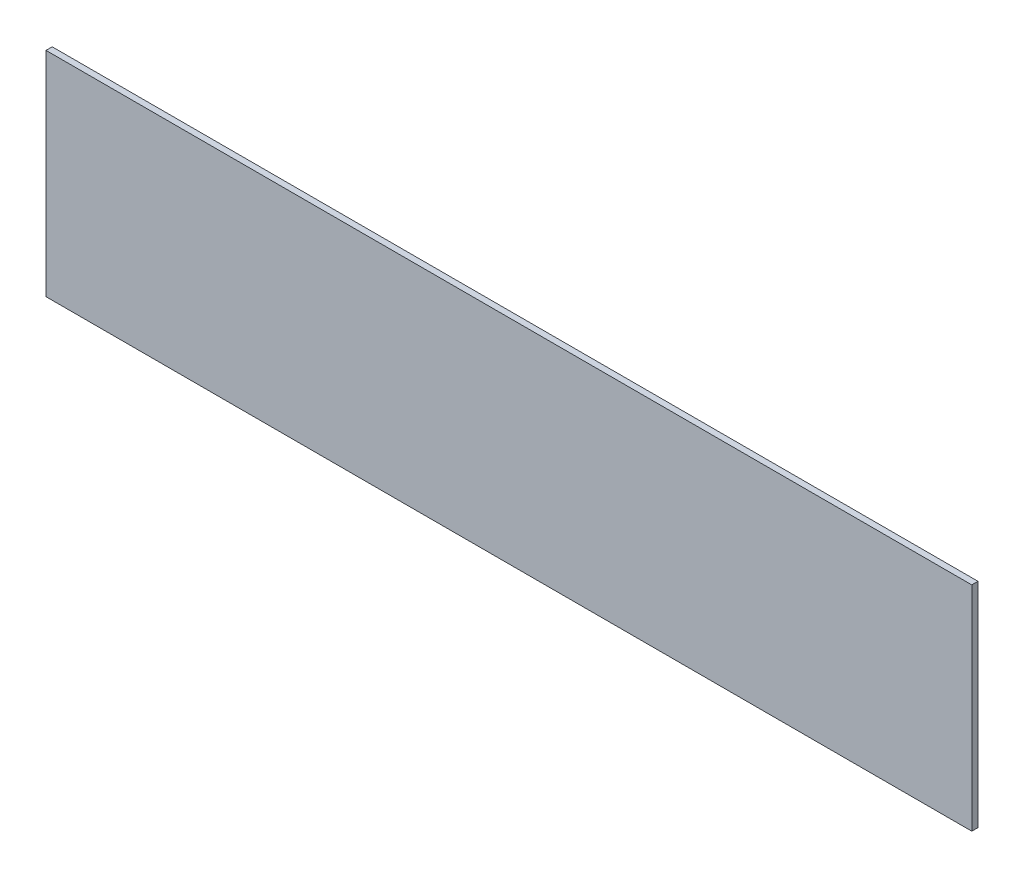
ISO-10303-21;
HEADER;
FILE_DESCRIPTION(('STEP AP214'),'2;1');
FILE_NAME('part.step','',(''),(''),'','','');
FILE_SCHEMA(('AUTOMOTIVE_DESIGN { 1 0 10303 214 1 1 1 1 }'));
ENDSEC;
DATA;
#1=APPLICATION_CONTEXT('core data for automotive mechanical design processes');
#2=APPLICATION_PROTOCOL_DEFINITION('international standard','automotive_design',2000,#1);
#3=PRODUCT_CONTEXT('',#1,'mechanical');
#4=PRODUCT('Part','Part','',(#3));
#5=PRODUCT_RELATED_PRODUCT_CATEGORY('part','',(#4));
#6=PRODUCT_DEFINITION_FORMATION('','',#4);
#7=PRODUCT_DEFINITION_CONTEXT('part definition',#1,'design');
#8=PRODUCT_DEFINITION('design','',#6,#7);
#9=PRODUCT_DEFINITION_SHAPE('','',#8);
#10=(LENGTH_UNIT() NAMED_UNIT(*) SI_UNIT(.MILLI.,.METRE.));
#11=(NAMED_UNIT(*) PLANE_ANGLE_UNIT() SI_UNIT($,.RADIAN.));
#12=(NAMED_UNIT(*) SI_UNIT($,.STERADIAN.) SOLID_ANGLE_UNIT());
#13=UNCERTAINTY_MEASURE_WITH_UNIT(LENGTH_MEASURE(1.E-05),#10,'distance_accuracy_value','');
#14=(GEOMETRIC_REPRESENTATION_CONTEXT(3) GLOBAL_UNCERTAINTY_ASSIGNED_CONTEXT((#13)) GLOBAL_UNIT_ASSIGNED_CONTEXT((#10,
#11,#12)) REPRESENTATION_CONTEXT('',''));
#15=CARTESIAN_POINT('',(0.,0.,0.));
#16=DIRECTION('',(0.,0.,1.));
#17=DIRECTION('',(1.,0.,0.));
#18=AXIS2_PLACEMENT_3D('',#15,#16,#17);
#19=CARTESIAN_POINT('',(0.,0.,3.));
#20=DIRECTION('',(0.,1.,0.));
#21=DIRECTION('',(0.,0.,1.));
#22=AXIS2_PLACEMENT_3D('',#19,#20,#21);
#23=PLANE('',#22);
#24=DIRECTION('',(1.,0.,0.));
#25=VECTOR('',#24,1.);
#26=CARTESIAN_POINT('',(0.,0.,3.));
#27=LINE('',#26,#25);
#28=CARTESIAN_POINT('',(2.99999999999999,0.,3.));
#29=VERTEX_POINT('',#28);
#30=CARTESIAN_POINT('',(450.,0.,3.));
#31=VERTEX_POINT('',#30);
#32=EDGE_CURVE('E85',#29,#31,#27,.T.);
#33=ORIENTED_EDGE('',*,*,#32,.F.);
#34=DIRECTION('',(0.,0.,-1.));
#35=VECTOR('',#34,1.);
#36=CARTESIAN_POINT('',(2.99999999999999,0.,10.));
#37=LINE('',#36,#35);
#38=CARTESIAN_POINT('',(2.99999999999999,0.,0.));
#39=VERTEX_POINT('',#38);
#40=EDGE_CURVE('E95',#29,#39,#37,.T.);
#41=ORIENTED_EDGE('',*,*,#40,.T.);
#42=DIRECTION('',(1.,0.,0.));
#43=VECTOR('',#42,1.);
#44=CARTESIAN_POINT('',(0.,0.,0.));
#45=LINE('',#44,#43);
#46=CARTESIAN_POINT('',(450.,0.,0.));
#47=VERTEX_POINT('',#46);
#48=EDGE_CURVE('E77',#39,#47,#45,.T.);
#49=ORIENTED_EDGE('',*,*,#48,.T.);
#50=DIRECTION('',(0.,0.,-1.));
#51=VECTOR('',#50,1.);
#52=CARTESIAN_POINT('',(450.,0.,3.));
#53=LINE('',#52,#51);
#54=EDGE_CURVE('E11',#31,#47,#53,.T.);
#55=ORIENTED_EDGE('',*,*,#54,.F.);
#56=EDGE_LOOP('',(#33,#41,#49,#55));
#57=FACE_BOUND('',#56,.T.);
#58=ADVANCED_FACE('F33',(#57),#23,.F.);
#59=CARTESIAN_POINT('',(450.,0.,3.));
#60=DIRECTION('',(-1.,0.,0.));
#61=DIRECTION('',(0.,0.,1.));
#62=AXIS2_PLACEMENT_3D('',#59,#60,#61);
#63=PLANE('',#62);
#64=DIRECTION('',(0.,1.,0.));
#65=VECTOR('',#64,1.);
#66=CARTESIAN_POINT('',(450.,0.,0.));
#67=LINE('',#66,#65);
#68=CARTESIAN_POINT('',(450.,103.,0.));
#69=VERTEX_POINT('',#68);
#70=EDGE_CURVE('E68',#47,#69,#67,.T.);
#71=ORIENTED_EDGE('',*,*,#70,.T.);
#72=DIRECTION('',(0.,0.,-1.));
#73=VECTOR('',#72,1.);
#74=CARTESIAN_POINT('',(450.,103.,3.));
#75=LINE('',#74,#73);
#76=CARTESIAN_POINT('',(450.,103.,3.));
#77=VERTEX_POINT('',#76);
#78=EDGE_CURVE('E40',#77,#69,#75,.T.);
#79=ORIENTED_EDGE('',*,*,#78,.F.);
#80=DIRECTION('',(0.,1.,0.));
#81=VECTOR('',#80,1.);
#82=CARTESIAN_POINT('',(450.,0.,3.));
#83=LINE('',#82,#81);
#84=EDGE_CURVE('E56',#31,#77,#83,.T.);
#85=ORIENTED_EDGE('',*,*,#84,.F.);
#86=ORIENTED_EDGE('',*,*,#54,.T.);
#87=EDGE_LOOP('',(#71,#79,#85,#86));
#88=FACE_BOUND('',#87,.T.);
#89=ADVANCED_FACE('F70',(#88),#63,.F.);
#90=CARTESIAN_POINT('',(0.,103.,3.));
#91=DIRECTION('',(0.,-1.,0.));
#92=DIRECTION('',(0.,0.,-1.));
#93=AXIS2_PLACEMENT_3D('',#90,#91,#92);
#94=PLANE('',#93);
#95=DIRECTION('',(-1.,0.,0.));
#96=VECTOR('',#95,1.);
#97=CARTESIAN_POINT('',(0.,103.,0.));
#98=LINE('',#97,#96);
#99=CARTESIAN_POINT('',(3.,103.,0.));
#100=VERTEX_POINT('',#99);
#101=EDGE_CURVE('E76',#69,#100,#98,.T.);
#102=ORIENTED_EDGE('',*,*,#101,.T.);
#103=DIRECTION('',(0.,0.,-1.));
#104=VECTOR('',#103,1.);
#105=CARTESIAN_POINT('',(3.,103.,10.));
#106=LINE('',#105,#104);
#107=CARTESIAN_POINT('',(3.,103.,3.));
#108=VERTEX_POINT('',#107);
#109=EDGE_CURVE('E47',#108,#100,#106,.T.);
#110=ORIENTED_EDGE('',*,*,#109,.F.);
#111=DIRECTION('',(-1.,0.,0.));
#112=VECTOR('',#111,1.);
#113=CARTESIAN_POINT('',(0.,103.,3.));
#114=LINE('',#113,#112);
#115=EDGE_CURVE('E82',#77,#108,#114,.T.);
#116=ORIENTED_EDGE('',*,*,#115,.F.);
#117=ORIENTED_EDGE('',*,*,#78,.T.);
#118=EDGE_LOOP('',(#102,#110,#116,#117));
#119=FACE_BOUND('',#118,.T.);
#120=ADVANCED_FACE('F81',(#119),#94,.F.);
#121=CARTESIAN_POINT('',(0.,0.,3.));
#122=DIRECTION('',(0.,0.,-1.));
#123=DIRECTION('',(-1.,0.,0.));
#124=AXIS2_PLACEMENT_3D('',#121,#122,#123);
#125=PLANE('',#124);
#126=ORIENTED_EDGE('',*,*,#115,.T.);
#127=DIRECTION('',(0.,-1.,0.));
#128=VECTOR('',#127,1.);
#129=CARTESIAN_POINT('',(2.99999999999999,0.,3.));
#130=LINE('',#129,#128);
#131=EDGE_CURVE('E90',#108,#29,#130,.T.);
#132=ORIENTED_EDGE('',*,*,#131,.T.);
#133=ORIENTED_EDGE('',*,*,#32,.T.);
#134=ORIENTED_EDGE('',*,*,#84,.T.);
#135=EDGE_LOOP('',(#126,#132,#133,#134));
#136=FACE_BOUND('',#135,.T.);
#137=ADVANCED_FACE('F106',(#136),#125,.F.);
#138=CARTESIAN_POINT('',(0.,0.,0.));
#139=DIRECTION('',(0.,0.,-1.));
#140=DIRECTION('',(-1.,0.,0.));
#141=AXIS2_PLACEMENT_3D('',#138,#139,#140);
#142=PLANE('',#141);
#143=DIRECTION('',(0.,-1.,0.));
#144=VECTOR('',#143,1.);
#145=CARTESIAN_POINT('',(3.,103.,0.));
#146=LINE('',#145,#144);
#147=EDGE_CURVE('E84',#100,#39,#146,.T.);
#148=ORIENTED_EDGE('',*,*,#147,.F.);
#149=ORIENTED_EDGE('',*,*,#101,.F.);
#150=ORIENTED_EDGE('',*,*,#70,.F.);
#151=ORIENTED_EDGE('',*,*,#48,.F.);
#152=EDGE_LOOP('',(#148,#149,#150,#151));
#153=FACE_BOUND('',#152,.T.);
#154=ADVANCED_FACE('F83',(#153),#142,.T.);
#155=CARTESIAN_POINT('',(3.,103.,10.));
#156=DIRECTION('',(1.,0.,0.));
#157=DIRECTION('',(0.,1.,0.));
#158=AXIS2_PLACEMENT_3D('',#155,#156,#157);
#159=PLANE('',#158);
#160=ORIENTED_EDGE('',*,*,#109,.T.);
#161=ORIENTED_EDGE('',*,*,#147,.T.);
#162=ORIENTED_EDGE('',*,*,#40,.F.);
#163=ORIENTED_EDGE('',*,*,#131,.F.);
#164=EDGE_LOOP('',(#160,#161,#162,#163));
#165=FACE_BOUND('',#164,.T.);
#166=ADVANCED_FACE('F101',(#165),#159,.F.);
#167=CLOSED_SHELL('',(#58,#89,#120,#137,#154,#166));
#168=MANIFOLD_SOLID_BREP('B2',#167);
#169=ADVANCED_BREP_SHAPE_REPRESENTATION('',(#18,#168),#14);
#170=SHAPE_DEFINITION_REPRESENTATION(#9,#169);
ENDSEC;
END-ISO-10303-21;
